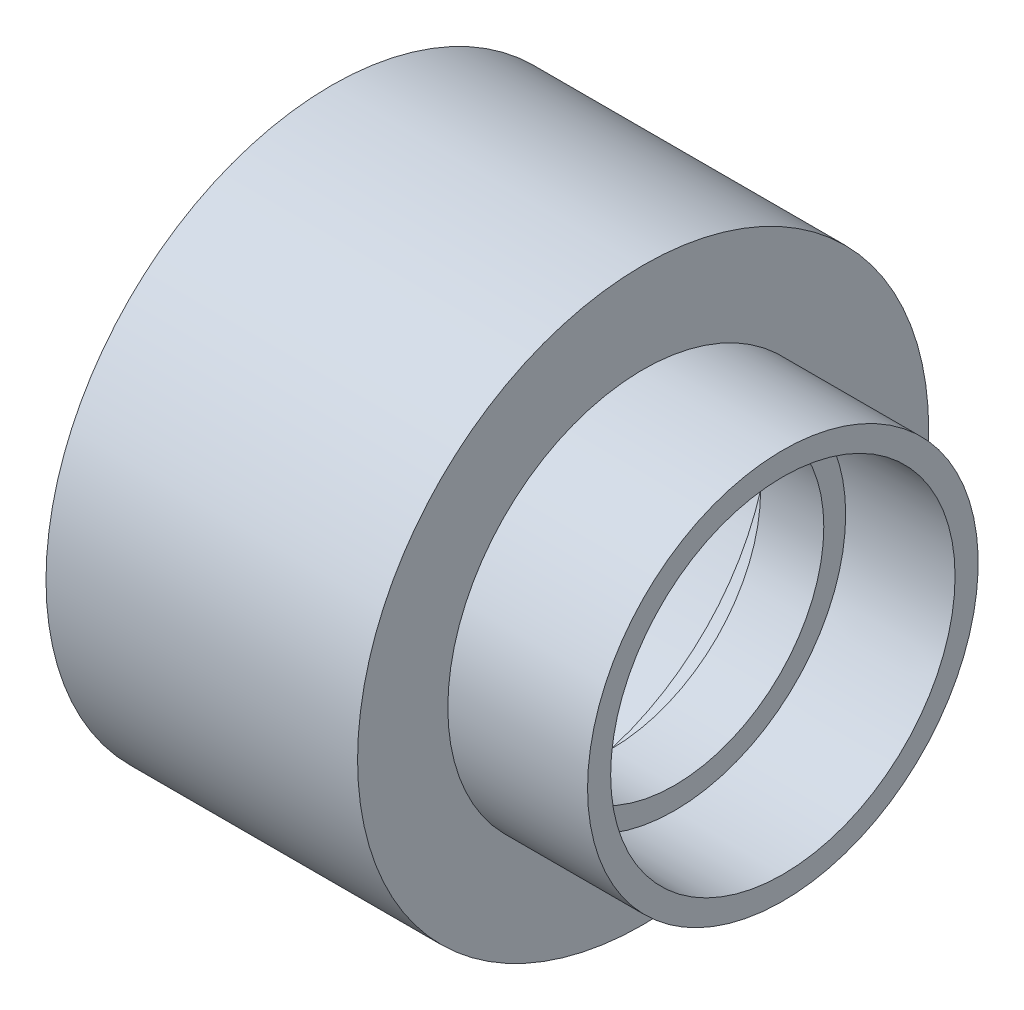
ISO-10303-21;
HEADER;
FILE_DESCRIPTION(('STEP AP214'),'2;1');
FILE_NAME('part.step','',(''),(''),'','','');
FILE_SCHEMA(('AUTOMOTIVE_DESIGN { 1 0 10303 214 1 1 1 1 }'));
ENDSEC;
DATA;
#1=APPLICATION_CONTEXT('core data for automotive mechanical design processes');
#2=APPLICATION_PROTOCOL_DEFINITION('international standard','automotive_design',2000,#1);
#3=PRODUCT_CONTEXT('',#1,'mechanical');
#4=PRODUCT('Part','Part','',(#3));
#5=PRODUCT_RELATED_PRODUCT_CATEGORY('part','',(#4));
#6=PRODUCT_DEFINITION_FORMATION('','',#4);
#7=PRODUCT_DEFINITION_CONTEXT('part definition',#1,'design');
#8=PRODUCT_DEFINITION('design','',#6,#7);
#9=PRODUCT_DEFINITION_SHAPE('','',#8);
#10=(LENGTH_UNIT() NAMED_UNIT(*) SI_UNIT(.MILLI.,.METRE.));
#11=(NAMED_UNIT(*) PLANE_ANGLE_UNIT() SI_UNIT($,.RADIAN.));
#12=(NAMED_UNIT(*) SI_UNIT($,.STERADIAN.) SOLID_ANGLE_UNIT());
#13=UNCERTAINTY_MEASURE_WITH_UNIT(LENGTH_MEASURE(1.E-05),#10,'distance_accuracy_value','');
#14=(GEOMETRIC_REPRESENTATION_CONTEXT(3) GLOBAL_UNCERTAINTY_ASSIGNED_CONTEXT((#13)) GLOBAL_UNIT_ASSIGNED_CONTEXT((#10,
#11,#12)) REPRESENTATION_CONTEXT('',''));
#15=CARTESIAN_POINT('',(0.,0.,0.));
#16=DIRECTION('',(0.,0.,1.));
#17=DIRECTION('',(1.,0.,0.));
#18=AXIS2_PLACEMENT_3D('',#15,#16,#17);
#19=CARTESIAN_POINT('',(-49.2125,-50.2285,0.));
#20=DIRECTION('',(-1.,0.,0.));
#21=DIRECTION('',(0.,0.,1.));
#22=AXIS2_PLACEMENT_3D('',#19,#20,#21);
#23=PLANE('',#22);
#24=CARTESIAN_POINT('',(-49.2125,0.,0.));
#25=DIRECTION('',(-1.,0.,0.));
#26=DIRECTION('',(0.,0.,1.));
#27=AXIS2_PLACEMENT_3D('',#24,#25,#26);
#28=CIRCLE('',#27,50.2285);
#29=CARTESIAN_POINT('',(-49.2125,0.,50.2285));
#30=VERTEX_POINT('',#29);
#31=EDGE_CURVE('E70',#30,#30,#28,.T.);
#32=ORIENTED_EDGE('',*,*,#31,.T.);
#33=EDGE_LOOP('',(#32));
#34=FACE_BOUND('',#33,.T.);
#35=CARTESIAN_POINT('',(-49.2125,0.,0.));
#36=DIRECTION('',(-1.,0.,0.));
#37=DIRECTION('',(0.,0.,1.));
#38=AXIS2_PLACEMENT_3D('',#35,#36,#37);
#39=CIRCLE('',#38,44.6405);
#40=CARTESIAN_POINT('',(-49.2125,0.,44.6405));
#41=VERTEX_POINT('',#40);
#42=EDGE_CURVE('E10',#41,#41,#39,.T.);
#43=ORIENTED_EDGE('',*,*,#42,.F.);
#44=EDGE_LOOP('',(#43));
#45=FACE_BOUND('',#44,.T.);
#46=ADVANCED_FACE('F30',(#34,#45),#23,.T.);
#47=CARTESIAN_POINT('',(-11.1125,0.,0.));
#48=DIRECTION('',(-1.,0.,0.));
#49=DIRECTION('',(0.,0.,1.));
#50=AXIS2_PLACEMENT_3D('',#47,#48,#49);
#51=CONICAL_SURFACE('',#50,44.3865,0.00666656790386816);
#52=ORIENTED_EDGE('',*,*,#42,.T.);
#53=EDGE_LOOP('',(#52));
#54=FACE_BOUND('',#53,.T.);
#55=CARTESIAN_POINT('',(-11.1125,0.,0.));
#56=DIRECTION('',(-1.,0.,0.));
#57=DIRECTION('',(0.,0.,1.));
#58=AXIS2_PLACEMENT_3D('',#55,#56,#57);
#59=CIRCLE('',#58,44.3865);
#60=CARTESIAN_POINT('',(-11.1125,0.,44.3865));
#61=VERTEX_POINT('',#60);
#62=EDGE_CURVE('E36',#61,#61,#59,.T.);
#63=ORIENTED_EDGE('',*,*,#62,.F.);
#64=EDGE_LOOP('',(#63));
#65=FACE_BOUND('',#64,.T.);
#66=ADVANCED_FACE('F88',(#54,#65),#51,.F.);
#67=CARTESIAN_POINT('',(-11.1125,-38.9636,0.));
#68=DIRECTION('',(-1.,0.,0.));
#69=DIRECTION('',(0.,0.,1.));
#70=AXIS2_PLACEMENT_3D('',#67,#68,#69);
#71=PLANE('',#70);
#72=ORIENTED_EDGE('',*,*,#62,.T.);
#73=EDGE_LOOP('',(#72));
#74=FACE_BOUND('',#73,.T.);
#75=CARTESIAN_POINT('',(-11.1125,0.,0.));
#76=DIRECTION('',(-1.,0.,0.));
#77=DIRECTION('',(0.,0.,1.));
#78=AXIS2_PLACEMENT_3D('',#75,#76,#77);
#79=CIRCLE('',#78,38.9636);
#80=CARTESIAN_POINT('',(-11.1125,0.,38.9636));
#81=VERTEX_POINT('',#80);
#82=EDGE_CURVE('E40',#81,#81,#79,.T.);
#83=ORIENTED_EDGE('',*,*,#82,.F.);
#84=EDGE_LOOP('',(#83));
#85=FACE_BOUND('',#84,.T.);
#86=ADVANCED_FACE('F92',(#74,#85),#71,.T.);
#87=CARTESIAN_POINT('',(-49.2125,0.,0.));
#88=DIRECTION('',(-1.,0.,0.));
#89=DIRECTION('',(0.,0.,1.));
#90=AXIS2_PLACEMENT_3D('',#87,#88,#89);
#91=CYLINDRICAL_SURFACE('',#90,38.9636);
#92=ORIENTED_EDGE('',*,*,#82,.T.);
#93=EDGE_LOOP('',(#92));
#94=FACE_BOUND('',#93,.T.);
#95=CARTESIAN_POINT('',(0.,0.,0.));
#96=DIRECTION('',(-1.,0.,0.));
#97=DIRECTION('',(0.,0.,1.));
#98=AXIS2_PLACEMENT_3D('',#95,#96,#97);
#99=CIRCLE('',#98,38.9636);
#100=CARTESIAN_POINT('',(0.,0.,38.9636));
#101=VERTEX_POINT('',#100);
#102=EDGE_CURVE('E44',#101,#101,#99,.T.);
#103=ORIENTED_EDGE('',*,*,#102,.F.);
#104=EDGE_LOOP('',(#103));
#105=FACE_BOUND('',#104,.T.);
#106=ADVANCED_FACE('F96',(#94,#105),#91,.F.);
#107=CARTESIAN_POINT('',(0.,-26.2509,0.));
#108=DIRECTION('',(-1.,0.,0.));
#109=DIRECTION('',(0.,0.,1.));
#110=AXIS2_PLACEMENT_3D('',#107,#108,#109);
#111=PLANE('',#110);
#112=ORIENTED_EDGE('',*,*,#102,.T.);
#113=EDGE_LOOP('',(#112));
#114=FACE_BOUND('',#113,.T.);
#115=CARTESIAN_POINT('',(0.,0.,0.));
#116=DIRECTION('',(-1.,0.,0.));
#117=DIRECTION('',(0.,0.,1.));
#118=AXIS2_PLACEMENT_3D('',#115,#116,#117);
#119=CIRCLE('',#118,26.2509);
#120=CARTESIAN_POINT('',(0.,0.,26.2509));
#121=VERTEX_POINT('',#120);
#122=EDGE_CURVE('E49',#121,#121,#119,.T.);
#123=ORIENTED_EDGE('',*,*,#122,.F.);
#124=EDGE_LOOP('',(#123));
#125=FACE_BOUND('',#124,.T.);
#126=ADVANCED_FACE('F102',(#114,#125),#111,.T.);
#127=CARTESIAN_POINT('',(-49.2125,0.,0.));
#128=DIRECTION('',(-1.,0.,0.));
#129=DIRECTION('',(0.,0.,1.));
#130=AXIS2_PLACEMENT_3D('',#127,#128,#129);
#131=CYLINDRICAL_SURFACE('',#130,26.2509);
#132=ORIENTED_EDGE('',*,*,#122,.T.);
#133=EDGE_LOOP('',(#132));
#134=FACE_BOUND('',#133,.T.);
#135=CARTESIAN_POINT('',(11.1125,0.,0.));
#136=DIRECTION('',(-1.,0.,0.));
#137=DIRECTION('',(0.,0.,1.));
#138=AXIS2_PLACEMENT_3D('',#135,#136,#137);
#139=CIRCLE('',#138,26.2509);
#140=CARTESIAN_POINT('',(11.1125,0.,26.2509));
#141=VERTEX_POINT('',#140);
#142=EDGE_CURVE('E52',#141,#141,#139,.T.);
#143=ORIENTED_EDGE('',*,*,#142,.F.);
#144=EDGE_LOOP('',(#143));
#145=FACE_BOUND('',#144,.T.);
#146=ADVANCED_FACE('F106',(#134,#145),#131,.F.);
#147=CARTESIAN_POINT('',(11.1125,-30.099,0.));
#148=DIRECTION('',(1.,0.,0.));
#149=DIRECTION('',(0.,0.,-1.));
#150=AXIS2_PLACEMENT_3D('',#147,#148,#149);
#151=PLANE('',#150);
#152=ORIENTED_EDGE('',*,*,#142,.T.);
#153=EDGE_LOOP('',(#152));
#154=FACE_BOUND('',#153,.T.);
#155=CARTESIAN_POINT('',(11.1125,0.,0.));
#156=DIRECTION('',(-1.,0.,0.));
#157=DIRECTION('',(0.,0.,1.));
#158=AXIS2_PLACEMENT_3D('',#155,#156,#157);
#159=CIRCLE('',#158,30.099);
#160=CARTESIAN_POINT('',(11.1125,0.,30.099));
#161=VERTEX_POINT('',#160);
#162=EDGE_CURVE('E55',#161,#161,#159,.T.);
#163=ORIENTED_EDGE('',*,*,#162,.F.);
#164=EDGE_LOOP('',(#163));
#165=FACE_BOUND('',#164,.T.);
#166=ADVANCED_FACE('F110',(#154,#165),#151,.T.);
#167=CARTESIAN_POINT('',(30.1625,0.,0.));
#168=DIRECTION('',(1.,0.,0.));
#169=DIRECTION('',(0.,0.,-1.));
#170=AXIS2_PLACEMENT_3D('',#167,#168,#169);
#171=CONICAL_SURFACE('',#170,30.2895,0.00999966668666486);
#172=ORIENTED_EDGE('',*,*,#162,.T.);
#173=EDGE_LOOP('',(#172));
#174=FACE_BOUND('',#173,.T.);
#175=CARTESIAN_POINT('',(30.1625,0.,0.));
#176=DIRECTION('',(-1.,0.,0.));
#177=DIRECTION('',(0.,0.,1.));
#178=AXIS2_PLACEMENT_3D('',#175,#176,#177);
#179=CIRCLE('',#178,30.2895);
#180=CARTESIAN_POINT('',(30.1625,0.,30.2895));
#181=VERTEX_POINT('',#180);
#182=EDGE_CURVE('E58',#181,#181,#179,.T.);
#183=ORIENTED_EDGE('',*,*,#182,.F.);
#184=EDGE_LOOP('',(#183));
#185=FACE_BOUND('',#184,.T.);
#186=ADVANCED_FACE('F114',(#174,#185),#171,.F.);
#187=CARTESIAN_POINT('',(30.1625,-34.3535,0.));
#188=DIRECTION('',(1.,0.,0.));
#189=DIRECTION('',(0.,0.,-1.));
#190=AXIS2_PLACEMENT_3D('',#187,#188,#189);
#191=PLANE('',#190);
#192=ORIENTED_EDGE('',*,*,#182,.T.);
#193=EDGE_LOOP('',(#192));
#194=FACE_BOUND('',#193,.T.);
#195=CARTESIAN_POINT('',(30.1625,0.,0.));
#196=DIRECTION('',(-1.,0.,0.));
#197=DIRECTION('',(0.,0.,1.));
#198=AXIS2_PLACEMENT_3D('',#195,#196,#197);
#199=CIRCLE('',#198,34.3535);
#200=CARTESIAN_POINT('',(30.1625,0.,34.3535));
#201=VERTEX_POINT('',#200);
#202=EDGE_CURVE('E61',#201,#201,#199,.T.);
#203=ORIENTED_EDGE('',*,*,#202,.F.);
#204=EDGE_LOOP('',(#203));
#205=FACE_BOUND('',#204,.T.);
#206=ADVANCED_FACE('F118',(#194,#205),#191,.T.);
#207=CARTESIAN_POINT('',(-49.2125,0.,0.));
#208=DIRECTION('',(-1.,0.,0.));
#209=DIRECTION('',(0.,0.,1.));
#210=AXIS2_PLACEMENT_3D('',#207,#208,#209);
#211=CYLINDRICAL_SURFACE('',#210,34.3535);
#212=ORIENTED_EDGE('',*,*,#202,.T.);
#213=EDGE_LOOP('',(#212));
#214=FACE_BOUND('',#213,.T.);
#215=CARTESIAN_POINT('',(5.58800000000001,0.,0.));
#216=DIRECTION('',(-1.,0.,0.));
#217=DIRECTION('',(0.,0.,1.));
#218=AXIS2_PLACEMENT_3D('',#215,#216,#217);
#219=CIRCLE('',#218,34.3535);
#220=CARTESIAN_POINT('',(5.58800000000001,0.,34.3535));
#221=VERTEX_POINT('',#220);
#222=EDGE_CURVE('E64',#221,#221,#219,.T.);
#223=ORIENTED_EDGE('',*,*,#222,.F.);
#224=EDGE_LOOP('',(#223));
#225=FACE_BOUND('',#224,.T.);
#226=ADVANCED_FACE('F84',(#214,#225),#211,.T.);
#227=CARTESIAN_POINT('',(5.58800000000001,-34.3535,0.));
#228=DIRECTION('',(1.,0.,0.));
#229=DIRECTION('',(0.,0.,-1.));
#230=AXIS2_PLACEMENT_3D('',#227,#228,#229);
#231=PLANE('',#230);
#232=ORIENTED_EDGE('',*,*,#222,.T.);
#233=EDGE_LOOP('',(#232));
#234=FACE_BOUND('',#233,.T.);
#235=CARTESIAN_POINT('',(5.58800000000001,0.,0.));
#236=DIRECTION('',(-1.,0.,0.));
#237=DIRECTION('',(0.,0.,1.));
#238=AXIS2_PLACEMENT_3D('',#235,#236,#237);
#239=CIRCLE('',#238,50.2285);
#240=CARTESIAN_POINT('',(5.58800000000001,0.,50.2285));
#241=VERTEX_POINT('',#240);
#242=EDGE_CURVE('E67',#241,#241,#239,.T.);
#243=ORIENTED_EDGE('',*,*,#242,.F.);
#244=EDGE_LOOP('',(#243));
#245=FACE_BOUND('',#244,.T.);
#246=ADVANCED_FACE('F78',(#234,#245),#231,.T.);
#247=CARTESIAN_POINT('',(-49.2125,0.,0.));
#248=DIRECTION('',(-1.,0.,0.));
#249=DIRECTION('',(0.,0.,1.));
#250=AXIS2_PLACEMENT_3D('',#247,#248,#249);
#251=CYLINDRICAL_SURFACE('',#250,50.2285);
#252=ORIENTED_EDGE('',*,*,#242,.T.);
#253=EDGE_LOOP('',(#252));
#254=FACE_BOUND('',#253,.T.);
#255=ORIENTED_EDGE('',*,*,#31,.F.);
#256=EDGE_LOOP('',(#255));
#257=FACE_BOUND('',#256,.T.);
#258=ADVANCED_FACE('F76',(#254,#257),#251,.T.);
#259=CLOSED_SHELL('',(#46,#66,#86,#106,#126,#146,#166,#186,#206,#226,#246,#258));
#260=MANIFOLD_SOLID_BREP('B2',#259);
#261=ADVANCED_BREP_SHAPE_REPRESENTATION('',(#18,#260),#14);
#262=SHAPE_DEFINITION_REPRESENTATION(#9,#261);
ENDSEC;
END-ISO-10303-21;
